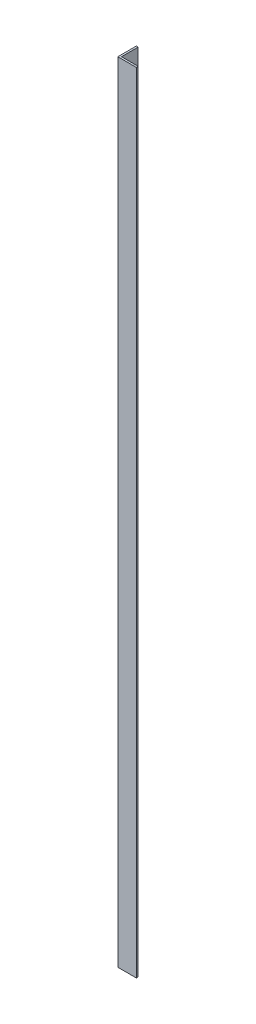
ISO-10303-21;
HEADER;
FILE_DESCRIPTION(('STEP AP214'),'2;1');
FILE_NAME('part.step','',(''),(''),'','','');
FILE_SCHEMA(('AUTOMOTIVE_DESIGN { 1 0 10303 214 1 1 1 1 }'));
ENDSEC;
DATA;
#1=APPLICATION_CONTEXT('core data for automotive mechanical design processes');
#2=APPLICATION_PROTOCOL_DEFINITION('international standard','automotive_design',2000,#1);
#3=PRODUCT_CONTEXT('',#1,'mechanical');
#4=PRODUCT('Part','Part','',(#3));
#5=PRODUCT_RELATED_PRODUCT_CATEGORY('part','',(#4));
#6=PRODUCT_DEFINITION_FORMATION('','',#4);
#7=PRODUCT_DEFINITION_CONTEXT('part definition',#1,'design');
#8=PRODUCT_DEFINITION('design','',#6,#7);
#9=PRODUCT_DEFINITION_SHAPE('','',#8);
#10=(LENGTH_UNIT() NAMED_UNIT(*) SI_UNIT(.MILLI.,.METRE.));
#11=(NAMED_UNIT(*) PLANE_ANGLE_UNIT() SI_UNIT($,.RADIAN.));
#12=(NAMED_UNIT(*) SI_UNIT($,.STERADIAN.) SOLID_ANGLE_UNIT());
#13=UNCERTAINTY_MEASURE_WITH_UNIT(LENGTH_MEASURE(1.E-05),#10,'distance_accuracy_value','');
#14=(GEOMETRIC_REPRESENTATION_CONTEXT(3) GLOBAL_UNCERTAINTY_ASSIGNED_CONTEXT((#13)) GLOBAL_UNIT_ASSIGNED_CONTEXT((#10,
#11,#12)) REPRESENTATION_CONTEXT('',''));
#15=CARTESIAN_POINT('',(0.,0.,0.));
#16=DIRECTION('',(0.,0.,1.));
#17=DIRECTION('',(1.,0.,0.));
#18=AXIS2_PLACEMENT_3D('',#15,#16,#17);
#19=CARTESIAN_POINT('',(5.,2125.,0.));
#20=DIRECTION('',(-1.,0.,0.));
#21=DIRECTION('',(0.,0.,1.));
#22=AXIS2_PLACEMENT_3D('',#19,#20,#21);
#23=PLANE('',#22);
#24=DIRECTION('',(0.,0.,-1.));
#25=VECTOR('',#24,1.);
#26=CARTESIAN_POINT('',(5.,0.,0.));
#27=LINE('',#26,#25);
#28=CARTESIAN_POINT('',(5.,0.,-5.));
#29=VERTEX_POINT('',#28);
#30=CARTESIAN_POINT('',(5.,0.,-50.));
#31=VERTEX_POINT('',#30);
#32=EDGE_CURVE('E132',#29,#31,#27,.T.);
#33=ORIENTED_EDGE('',*,*,#32,.T.);
#34=DIRECTION('',(0.,-1.,0.));
#35=VECTOR('',#34,1.);
#36=CARTESIAN_POINT('',(5.,2125.,-50.));
#37=LINE('',#36,#35);
#38=CARTESIAN_POINT('',(5.,2125.,-50.));
#39=VERTEX_POINT('',#38);
#40=EDGE_CURVE('E11',#39,#31,#37,.T.);
#41=ORIENTED_EDGE('',*,*,#40,.F.);
#42=DIRECTION('',(0.,0.,-1.));
#43=VECTOR('',#42,1.);
#44=CARTESIAN_POINT('',(5.,2125.,0.));
#45=LINE('',#44,#43);
#46=CARTESIAN_POINT('',(5.,2125.,-5.));
#47=VERTEX_POINT('',#46);
#48=EDGE_CURVE('E92',#47,#39,#45,.T.);
#49=ORIENTED_EDGE('',*,*,#48,.F.);
#50=DIRECTION('',(0.,-1.,0.));
#51=VECTOR('',#50,1.);
#52=CARTESIAN_POINT('',(5.,2125.,-5.));
#53=LINE('',#52,#51);
#54=EDGE_CURVE('E128',#47,#29,#53,.T.);
#55=ORIENTED_EDGE('',*,*,#54,.T.);
#56=EDGE_LOOP('',(#33,#41,#49,#55));
#57=FACE_BOUND('',#56,.T.);
#58=ADVANCED_FACE('F38',(#57),#23,.F.);
#59=CARTESIAN_POINT('',(0.,2125.,-50.));
#60=DIRECTION('',(0.,0.,-1.));
#61=DIRECTION('',(-1.,0.,0.));
#62=AXIS2_PLACEMENT_3D('',#59,#60,#61);
#63=PLANE('',#62);
#64=DIRECTION('',(1.,0.,0.));
#65=VECTOR('',#64,1.);
#66=CARTESIAN_POINT('',(0.,0.,-50.));
#67=LINE('',#66,#65);
#68=CARTESIAN_POINT('',(0.,0.,-50.));
#69=VERTEX_POINT('',#68);
#70=EDGE_CURVE('E136',#69,#31,#67,.T.);
#71=ORIENTED_EDGE('',*,*,#70,.F.);
#72=DIRECTION('',(0.,-1.,0.));
#73=VECTOR('',#72,1.);
#74=CARTESIAN_POINT('',(0.,2125.,-50.));
#75=LINE('',#74,#73);
#76=CARTESIAN_POINT('',(0.,2125.,-50.));
#77=VERTEX_POINT('',#76);
#78=EDGE_CURVE('E47',#77,#69,#75,.T.);
#79=ORIENTED_EDGE('',*,*,#78,.F.);
#80=DIRECTION('',(1.,0.,0.));
#81=VECTOR('',#80,1.);
#82=CARTESIAN_POINT('',(0.,2125.,-50.));
#83=LINE('',#82,#81);
#84=EDGE_CURVE('E235',#77,#39,#83,.T.);
#85=ORIENTED_EDGE('',*,*,#84,.T.);
#86=ORIENTED_EDGE('',*,*,#40,.T.);
#87=EDGE_LOOP('',(#71,#79,#85,#86));
#88=FACE_BOUND('',#87,.T.);
#89=ADVANCED_FACE('F161',(#88),#63,.T.);
#90=CARTESIAN_POINT('',(0.,2125.,0.));
#91=DIRECTION('',(-1.,0.,0.));
#92=DIRECTION('',(0.,0.,1.));
#93=AXIS2_PLACEMENT_3D('',#90,#91,#92);
#94=PLANE('',#93);
#95=DIRECTION('',(0.,0.,-1.));
#96=VECTOR('',#95,1.);
#97=CARTESIAN_POINT('',(0.,0.,0.));
#98=LINE('',#97,#96);
#99=CARTESIAN_POINT('',(0.,0.,0.));
#100=VERTEX_POINT('',#99);
#101=EDGE_CURVE('E139',#100,#69,#98,.T.);
#102=ORIENTED_EDGE('',*,*,#101,.F.);
#103=DIRECTION('',(0.,-1.,0.));
#104=VECTOR('',#103,1.);
#105=CARTESIAN_POINT('',(0.,2125.,0.));
#106=LINE('',#105,#104);
#107=CARTESIAN_POINT('',(0.,2125.,0.));
#108=VERTEX_POINT('',#107);
#109=EDGE_CURVE('E115',#108,#100,#106,.T.);
#110=ORIENTED_EDGE('',*,*,#109,.F.);
#111=DIRECTION('',(0.,0.,-1.));
#112=VECTOR('',#111,1.);
#113=CARTESIAN_POINT('',(0.,2125.,0.));
#114=LINE('',#113,#112);
#115=EDGE_CURVE('E121',#108,#77,#114,.T.);
#116=ORIENTED_EDGE('',*,*,#115,.T.);
#117=ORIENTED_EDGE('',*,*,#78,.T.);
#118=EDGE_LOOP('',(#102,#110,#116,#117));
#119=FACE_BOUND('',#118,.T.);
#120=ADVANCED_FACE('F158',(#119),#94,.T.);
#121=CARTESIAN_POINT('',(0.,2125.,0.));
#122=DIRECTION('',(0.,0.,1.));
#123=DIRECTION('',(1.,0.,0.));
#124=AXIS2_PLACEMENT_3D('',#121,#122,#123);
#125=PLANE('',#124);
#126=DIRECTION('',(-1.,0.,0.));
#127=VECTOR('',#126,1.);
#128=CARTESIAN_POINT('',(0.,0.,0.));
#129=LINE('',#128,#127);
#130=CARTESIAN_POINT('',(50.,0.,0.));
#131=VERTEX_POINT('',#130);
#132=EDGE_CURVE('E109',#131,#100,#129,.T.);
#133=ORIENTED_EDGE('',*,*,#132,.F.);
#134=DIRECTION('',(0.,-1.,0.));
#135=VECTOR('',#134,1.);
#136=CARTESIAN_POINT('',(50.,2125.,0.));
#137=LINE('',#136,#135);
#138=CARTESIAN_POINT('',(50.,2125.,0.));
#139=VERTEX_POINT('',#138);
#140=EDGE_CURVE('E104',#139,#131,#137,.T.);
#141=ORIENTED_EDGE('',*,*,#140,.F.);
#142=DIRECTION('',(-1.,0.,0.));
#143=VECTOR('',#142,1.);
#144=CARTESIAN_POINT('',(0.,2125.,0.));
#145=LINE('',#144,#143);
#146=EDGE_CURVE('E107',#139,#108,#145,.T.);
#147=ORIENTED_EDGE('',*,*,#146,.T.);
#148=ORIENTED_EDGE('',*,*,#109,.T.);
#149=EDGE_LOOP('',(#133,#141,#147,#148));
#150=FACE_BOUND('',#149,.T.);
#151=ADVANCED_FACE('F106',(#150),#125,.T.);
#152=CARTESIAN_POINT('',(50.,2125.,-5.));
#153=DIRECTION('',(1.,0.,0.));
#154=DIRECTION('',(0.,0.,-1.));
#155=AXIS2_PLACEMENT_3D('',#152,#153,#154);
#156=PLANE('',#155);
#157=DIRECTION('',(0.,0.,1.));
#158=VECTOR('',#157,1.);
#159=CARTESIAN_POINT('',(50.,0.,-5.));
#160=LINE('',#159,#158);
#161=CARTESIAN_POINT('',(50.,0.,-5.));
#162=VERTEX_POINT('',#161);
#163=EDGE_CURVE('E145',#162,#131,#160,.T.);
#164=ORIENTED_EDGE('',*,*,#163,.F.);
#165=DIRECTION('',(0.,-1.,0.));
#166=VECTOR('',#165,1.);
#167=CARTESIAN_POINT('',(50.,2125.,-5.));
#168=LINE('',#167,#166);
#169=CARTESIAN_POINT('',(50.,2125.,-5.));
#170=VERTEX_POINT('',#169);
#171=EDGE_CURVE('E81',#170,#162,#168,.T.);
#172=ORIENTED_EDGE('',*,*,#171,.F.);
#173=DIRECTION('',(0.,0.,1.));
#174=VECTOR('',#173,1.);
#175=CARTESIAN_POINT('',(50.,2125.,-5.));
#176=LINE('',#175,#174);
#177=EDGE_CURVE('E119',#170,#139,#176,.T.);
#178=ORIENTED_EDGE('',*,*,#177,.T.);
#179=ORIENTED_EDGE('',*,*,#140,.T.);
#180=EDGE_LOOP('',(#164,#172,#178,#179));
#181=FACE_BOUND('',#180,.T.);
#182=ADVANCED_FACE('F124',(#181),#156,.T.);
#183=CARTESIAN_POINT('',(0.,2125.,-5.));
#184=DIRECTION('',(0.,0.,1.));
#185=DIRECTION('',(1.,0.,0.));
#186=AXIS2_PLACEMENT_3D('',#183,#184,#185);
#187=PLANE('',#186);
#188=DIRECTION('',(1.,0.,0.));
#189=VECTOR('',#188,1.);
#190=CARTESIAN_POINT('',(0.,0.,-5.));
#191=LINE('',#190,#189);
#192=EDGE_CURVE('E86',#162,#29,#191,.F.);
#193=ORIENTED_EDGE('',*,*,#192,.T.);
#194=ORIENTED_EDGE('',*,*,#54,.F.);
#195=DIRECTION('',(1.,0.,0.));
#196=VECTOR('',#195,1.);
#197=CARTESIAN_POINT('',(0.,2125.,-5.));
#198=LINE('',#197,#196);
#199=EDGE_CURVE('E58',#170,#47,#198,.F.);
#200=ORIENTED_EDGE('',*,*,#199,.F.);
#201=ORIENTED_EDGE('',*,*,#171,.T.);
#202=EDGE_LOOP('',(#193,#194,#200,#201));
#203=FACE_BOUND('',#202,.T.);
#204=ADVANCED_FACE('F166',(#203),#187,.F.);
#205=CARTESIAN_POINT('',(0.,2125.,0.));
#206=DIRECTION('',(0.,-1.,0.));
#207=DIRECTION('',(-1.,0.,0.));
#208=AXIS2_PLACEMENT_3D('',#205,#206,#207);
#209=PLANE('',#208);
#210=ORIENTED_EDGE('',*,*,#48,.T.);
#211=ORIENTED_EDGE('',*,*,#84,.F.);
#212=ORIENTED_EDGE('',*,*,#115,.F.);
#213=ORIENTED_EDGE('',*,*,#146,.F.);
#214=ORIENTED_EDGE('',*,*,#177,.F.);
#215=ORIENTED_EDGE('',*,*,#199,.T.);
#216=EDGE_LOOP('',(#210,#211,#212,#213,#214,#215));
#217=FACE_BOUND('',#216,.T.);
#218=ADVANCED_FACE('F118',(#217),#209,.F.);
#219=CARTESIAN_POINT('',(0.,0.,0.));
#220=DIRECTION('',(0.,-1.,0.));
#221=DIRECTION('',(-1.,0.,0.));
#222=AXIS2_PLACEMENT_3D('',#219,#220,#221);
#223=PLANE('',#222);
#224=ORIENTED_EDGE('',*,*,#32,.F.);
#225=ORIENTED_EDGE('',*,*,#192,.F.);
#226=ORIENTED_EDGE('',*,*,#163,.T.);
#227=ORIENTED_EDGE('',*,*,#132,.T.);
#228=ORIENTED_EDGE('',*,*,#101,.T.);
#229=ORIENTED_EDGE('',*,*,#70,.T.);
#230=EDGE_LOOP('',(#224,#225,#226,#227,#228,#229));
#231=FACE_BOUND('',#230,.T.);
#232=ADVANCED_FACE('F164',(#231),#223,.T.);
#233=CLOSED_SHELL('',(#58,#89,#120,#151,#182,#204,#218,#232));
#234=MANIFOLD_SOLID_BREP('B2',#233);
#235=ADVANCED_BREP_SHAPE_REPRESENTATION('',(#18,#234),#14);
#236=SHAPE_DEFINITION_REPRESENTATION(#9,#235);
ENDSEC;
END-ISO-10303-21;
